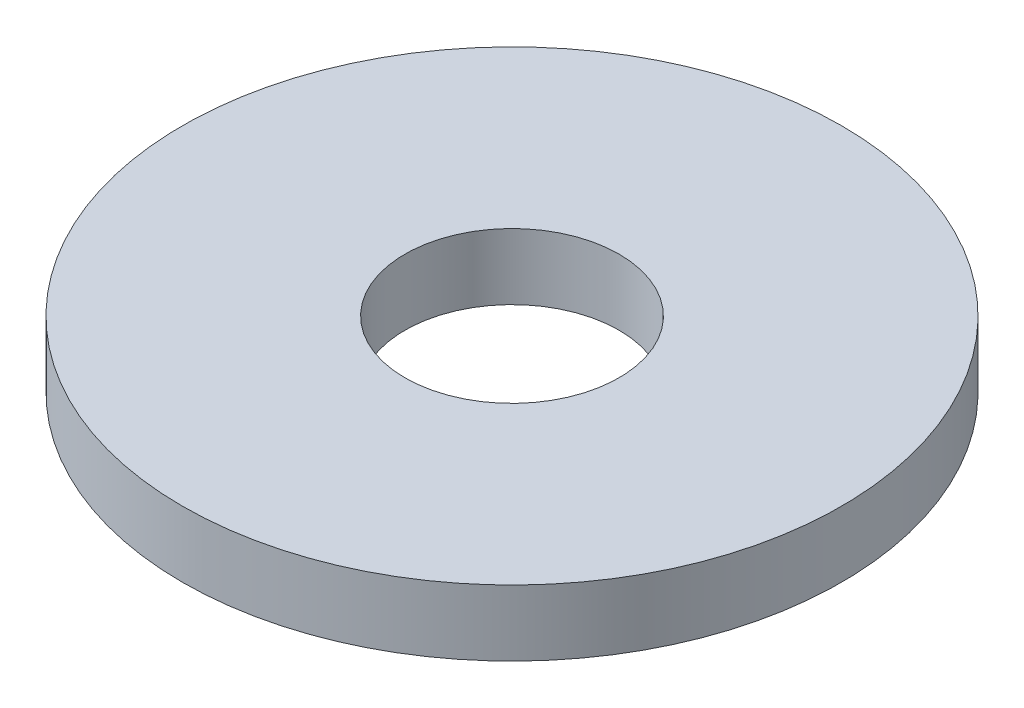
ISO-10303-21;
HEADER;
FILE_DESCRIPTION(('STEP AP214'),'2;1');
FILE_NAME('part.step','',(''),(''),'','','');
FILE_SCHEMA(('AUTOMOTIVE_DESIGN { 1 0 10303 214 1 1 1 1 }'));
ENDSEC;
DATA;
#1=APPLICATION_CONTEXT('core data for automotive mechanical design processes');
#2=APPLICATION_PROTOCOL_DEFINITION('international standard','automotive_design',2000,#1);
#3=PRODUCT_CONTEXT('',#1,'mechanical');
#4=PRODUCT('Part','Part','',(#3));
#5=PRODUCT_RELATED_PRODUCT_CATEGORY('part','',(#4));
#6=PRODUCT_DEFINITION_FORMATION('','',#4);
#7=PRODUCT_DEFINITION_CONTEXT('part definition',#1,'design');
#8=PRODUCT_DEFINITION('design','',#6,#7);
#9=PRODUCT_DEFINITION_SHAPE('','',#8);
#10=(LENGTH_UNIT() NAMED_UNIT(*) SI_UNIT(.MILLI.,.METRE.));
#11=(NAMED_UNIT(*) PLANE_ANGLE_UNIT() SI_UNIT($,.RADIAN.));
#12=(NAMED_UNIT(*) SI_UNIT($,.STERADIAN.) SOLID_ANGLE_UNIT());
#13=UNCERTAINTY_MEASURE_WITH_UNIT(LENGTH_MEASURE(1.E-05),#10,'distance_accuracy_value','');
#14=(GEOMETRIC_REPRESENTATION_CONTEXT(3) GLOBAL_UNCERTAINTY_ASSIGNED_CONTEXT((#13)) GLOBAL_UNIT_ASSIGNED_CONTEXT((#10,
#11,#12)) REPRESENTATION_CONTEXT('',''));
#15=CARTESIAN_POINT('',(0.,0.,0.));
#16=DIRECTION('',(0.,0.,1.));
#17=DIRECTION('',(1.,0.,0.));
#18=AXIS2_PLACEMENT_3D('',#15,#16,#17);
#19=CARTESIAN_POINT('',(0.,2.,0.));
#20=DIRECTION('',(0.,1.,0.));
#21=DIRECTION('',(0.,0.,1.));
#22=AXIS2_PLACEMENT_3D('',#19,#20,#21);
#23=PLANE('',#22);
#24=CARTESIAN_POINT('',(0.,2.,0.));
#25=DIRECTION('',(0.,1.,0.));
#26=DIRECTION('',(0.,0.,1.));
#27=AXIS2_PLACEMENT_3D('',#24,#25,#26);
#28=CIRCLE('',#27,10.);
#29=CARTESIAN_POINT('',(0.,2.,10.));
#30=VERTEX_POINT('',#29);
#31=EDGE_CURVE('E10',#30,#30,#28,.T.);
#32=ORIENTED_EDGE('',*,*,#31,.T.);
#33=EDGE_LOOP('',(#32));
#34=FACE_BOUND('',#33,.T.);
#35=CARTESIAN_POINT('',(0.,2.,0.));
#36=DIRECTION('',(0.,1.,0.));
#37=DIRECTION('',(0.,0.,1.));
#38=AXIS2_PLACEMENT_3D('',#35,#36,#37);
#39=CIRCLE('',#38,3.25);
#40=CARTESIAN_POINT('',(0.,2.,3.25));
#41=VERTEX_POINT('',#40);
#42=EDGE_CURVE('E48',#41,#41,#39,.T.);
#43=ORIENTED_EDGE('',*,*,#42,.F.);
#44=EDGE_LOOP('',(#43));
#45=FACE_BOUND('',#44,.T.);
#46=ADVANCED_FACE('F37',(#34,#45),#23,.T.);
#47=CARTESIAN_POINT('',(0.,0.,0.));
#48=DIRECTION('',(0.,1.,0.));
#49=DIRECTION('',(0.,0.,1.));
#50=AXIS2_PLACEMENT_3D('',#47,#48,#49);
#51=PLANE('',#50);
#52=CARTESIAN_POINT('',(0.,0.,0.));
#53=DIRECTION('',(0.,1.,0.));
#54=DIRECTION('',(0.,0.,1.));
#55=AXIS2_PLACEMENT_3D('',#52,#53,#54);
#56=CIRCLE('',#55,10.);
#57=CARTESIAN_POINT('',(0.,0.,10.));
#58=VERTEX_POINT('',#57);
#59=EDGE_CURVE('E41',#58,#58,#56,.T.);
#60=ORIENTED_EDGE('',*,*,#59,.F.);
#61=EDGE_LOOP('',(#60));
#62=FACE_BOUND('',#61,.T.);
#63=CARTESIAN_POINT('',(0.,0.,0.));
#64=DIRECTION('',(0.,1.,0.));
#65=DIRECTION('',(0.,0.,1.));
#66=AXIS2_PLACEMENT_3D('',#63,#64,#65);
#67=CIRCLE('',#66,3.25);
#68=CARTESIAN_POINT('',(0.,0.,3.25));
#69=VERTEX_POINT('',#68);
#70=EDGE_CURVE('E50',#69,#69,#67,.T.);
#71=ORIENTED_EDGE('',*,*,#70,.T.);
#72=EDGE_LOOP('',(#71));
#73=FACE_BOUND('',#72,.T.);
#74=ADVANCED_FACE('F60',(#62,#73),#51,.F.);
#75=CARTESIAN_POINT('',(0.,2.,0.));
#76=DIRECTION('',(0.,-1.,0.));
#77=DIRECTION('',(0.,0.,-1.));
#78=AXIS2_PLACEMENT_3D('',#75,#76,#77);
#79=CYLINDRICAL_SURFACE('',#78,10.);
#80=ORIENTED_EDGE('',*,*,#31,.F.);
#81=EDGE_LOOP('',(#80));
#82=FACE_BOUND('',#81,.T.);
#83=ORIENTED_EDGE('',*,*,#59,.T.);
#84=EDGE_LOOP('',(#83));
#85=FACE_BOUND('',#84,.T.);
#86=ADVANCED_FACE('F39',(#82,#85),#79,.T.);
#87=CARTESIAN_POINT('',(0.,2.,0.));
#88=DIRECTION('',(0.,-1.,0.));
#89=DIRECTION('',(0.,0.,-1.));
#90=AXIS2_PLACEMENT_3D('',#87,#88,#89);
#91=CYLINDRICAL_SURFACE('',#90,3.25);
#92=ORIENTED_EDGE('',*,*,#42,.T.);
#93=EDGE_LOOP('',(#92));
#94=FACE_BOUND('',#93,.T.);
#95=ORIENTED_EDGE('',*,*,#70,.F.);
#96=EDGE_LOOP('',(#95));
#97=FACE_BOUND('',#96,.T.);
#98=ADVANCED_FACE('F56',(#94,#97),#91,.F.);
#99=CLOSED_SHELL('',(#46,#74,#86,#98));
#100=MANIFOLD_SOLID_BREP('B2',#99);
#101=ADVANCED_BREP_SHAPE_REPRESENTATION('',(#18,#100),#14);
#102=SHAPE_DEFINITION_REPRESENTATION(#9,#101);
ENDSEC;
END-ISO-10303-21;
